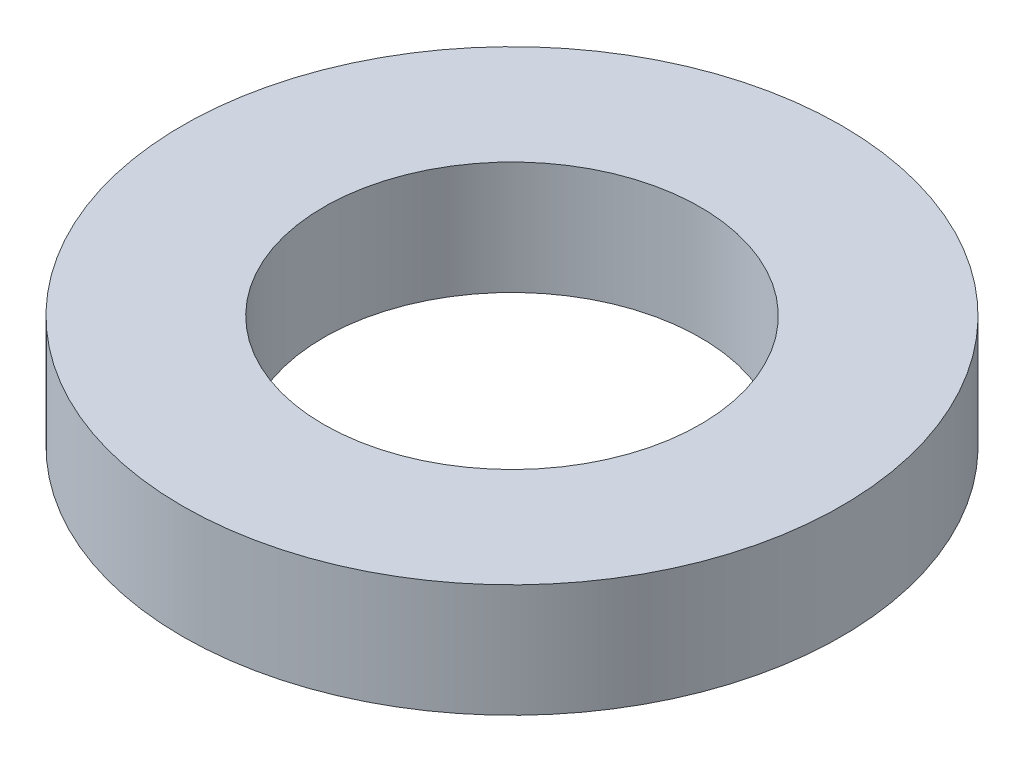
ISO-10303-21;
HEADER;
FILE_DESCRIPTION(('STEP AP214'),'2;1');
FILE_NAME('part.step','',(''),(''),'','','');
FILE_SCHEMA(('AUTOMOTIVE_DESIGN { 1 0 10303 214 1 1 1 1 }'));
ENDSEC;
DATA;
#1=APPLICATION_CONTEXT('core data for automotive mechanical design processes');
#2=APPLICATION_PROTOCOL_DEFINITION('international standard','automotive_design',2000,#1);
#3=PRODUCT_CONTEXT('',#1,'mechanical');
#4=PRODUCT('Part','Part','',(#3));
#5=PRODUCT_RELATED_PRODUCT_CATEGORY('part','',(#4));
#6=PRODUCT_DEFINITION_FORMATION('','',#4);
#7=PRODUCT_DEFINITION_CONTEXT('part definition',#1,'design');
#8=PRODUCT_DEFINITION('design','',#6,#7);
#9=PRODUCT_DEFINITION_SHAPE('','',#8);
#10=(LENGTH_UNIT() NAMED_UNIT(*) SI_UNIT(.MILLI.,.METRE.));
#11=(NAMED_UNIT(*) PLANE_ANGLE_UNIT() SI_UNIT($,.RADIAN.));
#12=(NAMED_UNIT(*) SI_UNIT($,.STERADIAN.) SOLID_ANGLE_UNIT());
#13=UNCERTAINTY_MEASURE_WITH_UNIT(LENGTH_MEASURE(1.E-05),#10,'distance_accuracy_value','');
#14=(GEOMETRIC_REPRESENTATION_CONTEXT(3) GLOBAL_UNCERTAINTY_ASSIGNED_CONTEXT((#13)) GLOBAL_UNIT_ASSIGNED_CONTEXT((#10,
#11,#12)) REPRESENTATION_CONTEXT('',''));
#15=CARTESIAN_POINT('',(0.,0.,0.));
#16=DIRECTION('',(0.,0.,1.));
#17=DIRECTION('',(1.,0.,0.));
#18=AXIS2_PLACEMENT_3D('',#15,#16,#17);
#19=CARTESIAN_POINT('',(0.,30.,0.));
#20=DIRECTION('',(0.,-1.,0.));
#21=DIRECTION('',(0.,0.,-1.));
#22=AXIS2_PLACEMENT_3D('',#19,#20,#21);
#23=CYLINDRICAL_SURFACE('',#22,87.5);
#24=CARTESIAN_POINT('',(0.,30.,0.));
#25=DIRECTION('',(0.,1.,0.));
#26=DIRECTION('',(0.,0.,1.));
#27=AXIS2_PLACEMENT_3D('',#24,#25,#26);
#28=CIRCLE('',#27,87.5);
#29=CARTESIAN_POINT('',(0.,30.,87.5));
#30=VERTEX_POINT('',#29);
#31=EDGE_CURVE('E10',#30,#30,#28,.T.);
#32=ORIENTED_EDGE('',*,*,#31,.F.);
#33=EDGE_LOOP('',(#32));
#34=FACE_BOUND('',#33,.T.);
#35=CARTESIAN_POINT('',(0.,0.,0.));
#36=DIRECTION('',(0.,1.,0.));
#37=DIRECTION('',(0.,0.,1.));
#38=AXIS2_PLACEMENT_3D('',#35,#36,#37);
#39=CIRCLE('',#38,87.5);
#40=CARTESIAN_POINT('',(0.,0.,87.5));
#41=VERTEX_POINT('',#40);
#42=EDGE_CURVE('E37',#41,#41,#39,.T.);
#43=ORIENTED_EDGE('',*,*,#42,.T.);
#44=EDGE_LOOP('',(#43));
#45=FACE_BOUND('',#44,.T.);
#46=ADVANCED_FACE('F40',(#34,#45),#23,.T.);
#47=CARTESIAN_POINT('',(0.,30.,0.));
#48=DIRECTION('',(0.,1.,0.));
#49=DIRECTION('',(0.,0.,1.));
#50=AXIS2_PLACEMENT_3D('',#47,#48,#49);
#51=PLANE('',#50);
#52=CARTESIAN_POINT('',(0.,30.,0.));
#53=DIRECTION('',(0.,1.,0.));
#54=DIRECTION('',(0.,0.,1.));
#55=AXIS2_PLACEMENT_3D('',#52,#53,#54);
#56=CIRCLE('',#55,50.);
#57=CARTESIAN_POINT('',(0.,30.,50.));
#58=VERTEX_POINT('',#57);
#59=EDGE_CURVE('E50',#58,#58,#56,.T.);
#60=ORIENTED_EDGE('',*,*,#59,.F.);
#61=EDGE_LOOP('',(#60));
#62=FACE_BOUND('',#61,.T.);
#63=ORIENTED_EDGE('',*,*,#31,.T.);
#64=EDGE_LOOP('',(#63));
#65=FACE_BOUND('',#64,.T.);
#66=ADVANCED_FACE('F59',(#62,#65),#51,.T.);
#67=CARTESIAN_POINT('',(0.,0.,0.));
#68=DIRECTION('',(0.,1.,0.));
#69=DIRECTION('',(0.,0.,1.));
#70=AXIS2_PLACEMENT_3D('',#67,#68,#69);
#71=PLANE('',#70);
#72=CARTESIAN_POINT('',(0.,0.,0.));
#73=DIRECTION('',(0.,1.,0.));
#74=DIRECTION('',(0.,0.,1.));
#75=AXIS2_PLACEMENT_3D('',#72,#73,#74);
#76=CIRCLE('',#75,50.);
#77=CARTESIAN_POINT('',(0.,0.,50.));
#78=VERTEX_POINT('',#77);
#79=EDGE_CURVE('E47',#78,#78,#76,.T.);
#80=ORIENTED_EDGE('',*,*,#79,.T.);
#81=EDGE_LOOP('',(#80));
#82=FACE_BOUND('',#81,.T.);
#83=ORIENTED_EDGE('',*,*,#42,.F.);
#84=EDGE_LOOP('',(#83));
#85=FACE_BOUND('',#84,.T.);
#86=ADVANCED_FACE('F58',(#82,#85),#71,.F.);
#87=CARTESIAN_POINT('',(0.,30.,0.));
#88=DIRECTION('',(0.,-1.,0.));
#89=DIRECTION('',(0.,0.,-1.));
#90=AXIS2_PLACEMENT_3D('',#87,#88,#89);
#91=CYLINDRICAL_SURFACE('',#90,50.);
#92=ORIENTED_EDGE('',*,*,#59,.T.);
#93=EDGE_LOOP('',(#92));
#94=FACE_BOUND('',#93,.T.);
#95=ORIENTED_EDGE('',*,*,#79,.F.);
#96=EDGE_LOOP('',(#95));
#97=FACE_BOUND('',#96,.T.);
#98=ADVANCED_FACE('F54',(#94,#97),#91,.F.);
#99=CLOSED_SHELL('',(#46,#66,#86,#98));
#100=MANIFOLD_SOLID_BREP('B2',#99);
#101=ADVANCED_BREP_SHAPE_REPRESENTATION('',(#18,#100),#14);
#102=SHAPE_DEFINITION_REPRESENTATION(#9,#101);
ENDSEC;
END-ISO-10303-21;
